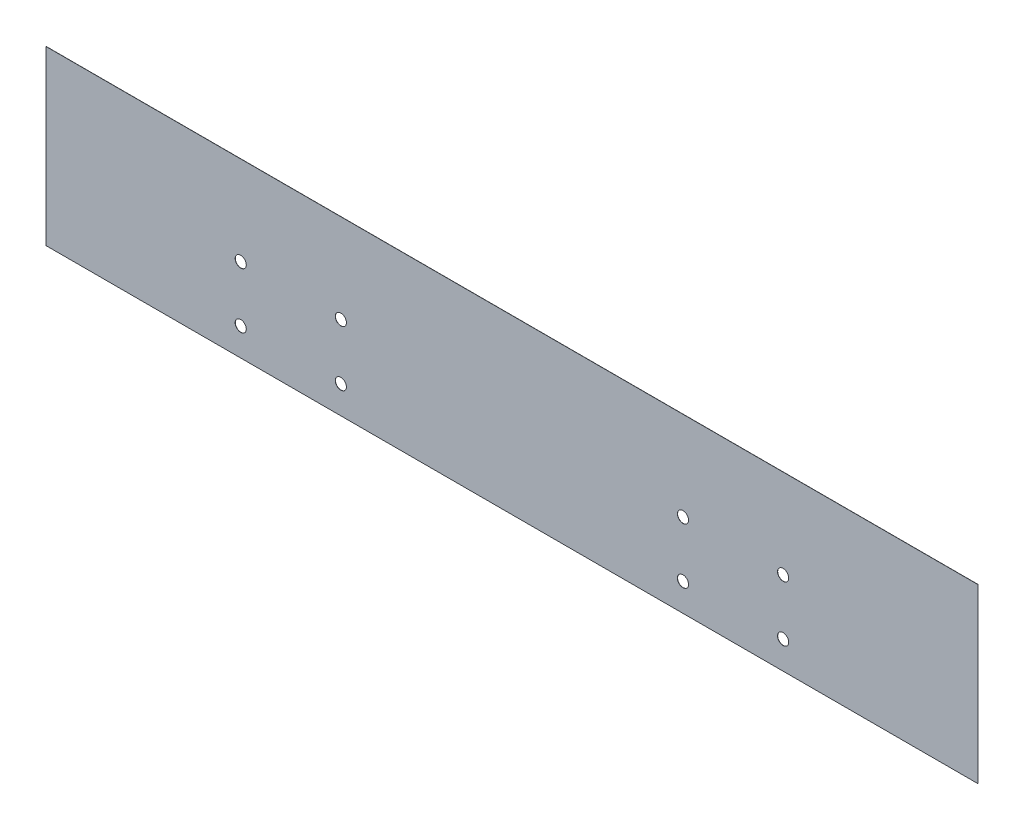
ISO-10303-21;
HEADER;
FILE_DESCRIPTION(('STEP AP214'),'2;1');
FILE_NAME('part.step','',(''),(''),'','','');
FILE_SCHEMA(('AUTOMOTIVE_DESIGN { 1 0 10303 214 1 1 1 1 }'));
ENDSEC;
DATA;
#1=APPLICATION_CONTEXT('core data for automotive mechanical design processes');
#2=APPLICATION_PROTOCOL_DEFINITION('international standard','automotive_design',2000,#1);
#3=PRODUCT_CONTEXT('',#1,'mechanical');
#4=PRODUCT('Part','Part','',(#3));
#5=PRODUCT_RELATED_PRODUCT_CATEGORY('part','',(#4));
#6=PRODUCT_DEFINITION_FORMATION('','',#4);
#7=PRODUCT_DEFINITION_CONTEXT('part definition',#1,'design');
#8=PRODUCT_DEFINITION('design','',#6,#7);
#9=PRODUCT_DEFINITION_SHAPE('','',#8);
#10=(LENGTH_UNIT() NAMED_UNIT(*) SI_UNIT(.MILLI.,.METRE.));
#11=(NAMED_UNIT(*) PLANE_ANGLE_UNIT() SI_UNIT($,.RADIAN.));
#12=(NAMED_UNIT(*) SI_UNIT($,.STERADIAN.) SOLID_ANGLE_UNIT());
#13=UNCERTAINTY_MEASURE_WITH_UNIT(LENGTH_MEASURE(1.E-05),#10,'distance_accuracy_value','');
#14=(GEOMETRIC_REPRESENTATION_CONTEXT(3) GLOBAL_UNCERTAINTY_ASSIGNED_CONTEXT((#13)) GLOBAL_UNIT_ASSIGNED_CONTEXT((#10,
#11,#12)) REPRESENTATION_CONTEXT('',''));
#15=CARTESIAN_POINT('',(0.,0.,0.));
#16=DIRECTION('',(0.,0.,1.));
#17=DIRECTION('',(1.,0.,0.));
#18=AXIS2_PLACEMENT_3D('',#15,#16,#17);
#19=CARTESIAN_POINT('',(167.5,-31.,0.0625));
#20=DIRECTION('',(-1.,0.,0.));
#21=DIRECTION('',(0.,0.,1.));
#22=AXIS2_PLACEMENT_3D('',#19,#20,#21);
#23=PLANE('',#22);
#24=DIRECTION('',(0.,1.,0.));
#25=VECTOR('',#24,1.);
#26=CARTESIAN_POINT('',(167.5,-31.,0.));
#27=LINE('',#26,#25);
#28=CARTESIAN_POINT('',(167.5,-31.,0.));
#29=VERTEX_POINT('',#28);
#30=CARTESIAN_POINT('',(167.5,31.,0.));
#31=VERTEX_POINT('',#30);
#32=EDGE_CURVE('E96',#29,#31,#27,.T.);
#33=ORIENTED_EDGE('',*,*,#32,.T.);
#34=DIRECTION('',(0.,0.,-1.));
#35=VECTOR('',#34,1.);
#36=CARTESIAN_POINT('',(167.5,31.,0.0625));
#37=LINE('',#36,#35);
#38=CARTESIAN_POINT('',(167.5,31.,0.0625));
#39=VERTEX_POINT('',#38);
#40=EDGE_CURVE('E11',#39,#31,#37,.T.);
#41=ORIENTED_EDGE('',*,*,#40,.F.);
#42=DIRECTION('',(0.,1.,0.));
#43=VECTOR('',#42,1.);
#44=CARTESIAN_POINT('',(167.5,-31.,0.0625));
#45=LINE('',#44,#43);
#46=CARTESIAN_POINT('',(167.5,-31.,0.0625));
#47=VERTEX_POINT('',#46);
#48=EDGE_CURVE('E84',#47,#39,#45,.T.);
#49=ORIENTED_EDGE('',*,*,#48,.F.);
#50=DIRECTION('',(0.,0.,-1.));
#51=VECTOR('',#50,1.);
#52=CARTESIAN_POINT('',(167.5,-31.,0.0625));
#53=LINE('',#52,#51);
#54=EDGE_CURVE('E92',#47,#29,#53,.T.);
#55=ORIENTED_EDGE('',*,*,#54,.T.);
#56=EDGE_LOOP('',(#33,#41,#49,#55));
#57=FACE_BOUND('',#56,.T.);
#58=ADVANCED_FACE('F33',(#57),#23,.F.);
#59=CARTESIAN_POINT('',(-167.5,31.,0.0625));
#60=DIRECTION('',(0.,-1.,0.));
#61=DIRECTION('',(0.,0.,-1.));
#62=AXIS2_PLACEMENT_3D('',#59,#60,#61);
#63=PLANE('',#62);
#64=DIRECTION('',(-1.,0.,0.));
#65=VECTOR('',#64,1.);
#66=CARTESIAN_POINT('',(-167.5,31.,0.));
#67=LINE('',#66,#65);
#68=CARTESIAN_POINT('',(-167.5,31.,0.));
#69=VERTEX_POINT('',#68);
#70=EDGE_CURVE('E88',#31,#69,#67,.T.);
#71=ORIENTED_EDGE('',*,*,#70,.T.);
#72=DIRECTION('',(0.,0.,-1.));
#73=VECTOR('',#72,1.);
#74=CARTESIAN_POINT('',(-167.5,31.,0.0625));
#75=LINE('',#74,#73);
#76=CARTESIAN_POINT('',(-167.5,31.,0.0625));
#77=VERTEX_POINT('',#76);
#78=EDGE_CURVE('E41',#77,#69,#75,.T.);
#79=ORIENTED_EDGE('',*,*,#78,.F.);
#80=DIRECTION('',(-1.,0.,0.));
#81=VECTOR('',#80,1.);
#82=CARTESIAN_POINT('',(-167.5,31.,0.0625));
#83=LINE('',#82,#81);
#84=EDGE_CURVE('E79',#39,#77,#83,.T.);
#85=ORIENTED_EDGE('',*,*,#84,.F.);
#86=ORIENTED_EDGE('',*,*,#40,.T.);
#87=EDGE_LOOP('',(#71,#79,#85,#86));
#88=FACE_BOUND('',#87,.T.);
#89=ADVANCED_FACE('F87',(#88),#63,.F.);
#90=CARTESIAN_POINT('',(-167.5,-31.,0.0625));
#91=DIRECTION('',(1.,0.,0.));
#92=DIRECTION('',(0.,0.,-1.));
#93=AXIS2_PLACEMENT_3D('',#90,#91,#92);
#94=PLANE('',#93);
#95=DIRECTION('',(0.,-1.,0.));
#96=VECTOR('',#95,1.);
#97=CARTESIAN_POINT('',(-167.5,-31.,0.));
#98=LINE('',#97,#96);
#99=CARTESIAN_POINT('',(-167.5,-31.,0.));
#100=VERTEX_POINT('',#99);
#101=EDGE_CURVE('E66',#69,#100,#98,.T.);
#102=ORIENTED_EDGE('',*,*,#101,.T.);
#103=DIRECTION('',(0.,0.,-1.));
#104=VECTOR('',#103,1.);
#105=CARTESIAN_POINT('',(-167.5,-31.,0.0625));
#106=LINE('',#105,#104);
#107=CARTESIAN_POINT('',(-167.5,-31.,0.0625));
#108=VERTEX_POINT('',#107);
#109=EDGE_CURVE('E89',#108,#100,#106,.T.);
#110=ORIENTED_EDGE('',*,*,#109,.F.);
#111=DIRECTION('',(0.,-1.,0.));
#112=VECTOR('',#111,1.);
#113=CARTESIAN_POINT('',(-167.5,-31.,0.0625));
#114=LINE('',#113,#112);
#115=EDGE_CURVE('E82',#77,#108,#114,.T.);
#116=ORIENTED_EDGE('',*,*,#115,.F.);
#117=ORIENTED_EDGE('',*,*,#78,.T.);
#118=EDGE_LOOP('',(#102,#110,#116,#117));
#119=FACE_BOUND('',#118,.T.);
#120=ADVANCED_FACE('F90',(#119),#94,.F.);
#121=CARTESIAN_POINT('',(-167.5,-31.,0.0625));
#122=DIRECTION('',(0.,1.,0.));
#123=DIRECTION('',(0.,0.,1.));
#124=AXIS2_PLACEMENT_3D('',#121,#122,#123);
#125=PLANE('',#124);
#126=DIRECTION('',(1.,0.,0.));
#127=VECTOR('',#126,1.);
#128=CARTESIAN_POINT('',(-167.5,-31.,0.));
#129=LINE('',#128,#127);
#130=EDGE_CURVE('E72',#100,#29,#129,.T.);
#131=ORIENTED_EDGE('',*,*,#130,.T.);
#132=ORIENTED_EDGE('',*,*,#54,.F.);
#133=DIRECTION('',(1.,0.,0.));
#134=VECTOR('',#133,1.);
#135=CARTESIAN_POINT('',(-167.5,-31.,0.0625));
#136=LINE('',#135,#134);
#137=EDGE_CURVE('E49',#108,#47,#136,.T.);
#138=ORIENTED_EDGE('',*,*,#137,.F.);
#139=ORIENTED_EDGE('',*,*,#109,.T.);
#140=EDGE_LOOP('',(#131,#132,#138,#139));
#141=FACE_BOUND('',#140,.T.);
#142=ADVANCED_FACE('F104',(#141),#125,.F.);
#143=CARTESIAN_POINT('',(0.,0.,0.0625));
#144=DIRECTION('',(0.,0.,-1.));
#145=DIRECTION('',(-1.,0.,0.));
#146=AXIS2_PLACEMENT_3D('',#143,#144,#145);
#147=PLANE('',#146);
#148=CARTESIAN_POINT('',(-97.5,-21.,0.0625));
#149=DIRECTION('',(0.,0.,1.));
#150=DIRECTION('',(1.,0.,0.));
#151=AXIS2_PLACEMENT_3D('',#148,#149,#150);
#152=CIRCLE('',#151,2.);
#153=CARTESIAN_POINT('',(-95.5,-21.,0.0625));
#154=VERTEX_POINT('',#153);
#155=EDGE_CURVE('E147',#154,#154,#152,.T.);
#156=ORIENTED_EDGE('',*,*,#155,.F.);
#157=EDGE_LOOP('',(#156));
#158=FACE_BOUND('',#157,.T.);
#159=CARTESIAN_POINT('',(97.5,-1.,0.0625));
#160=DIRECTION('',(0.,0.,1.));
#161=DIRECTION('',(1.,0.,0.));
#162=AXIS2_PLACEMENT_3D('',#159,#160,#161);
#163=CIRCLE('',#162,2.);
#164=CARTESIAN_POINT('',(99.5,-1.,0.0625));
#165=VERTEX_POINT('',#164);
#166=EDGE_CURVE('E140',#165,#165,#163,.T.);
#167=ORIENTED_EDGE('',*,*,#166,.F.);
#168=EDGE_LOOP('',(#167));
#169=FACE_BOUND('',#168,.T.);
#170=CARTESIAN_POINT('',(97.5,-21.,0.0625));
#171=DIRECTION('',(0.,0.,1.));
#172=DIRECTION('',(1.,0.,0.));
#173=AXIS2_PLACEMENT_3D('',#170,#171,#172);
#174=CIRCLE('',#173,2.);
#175=CARTESIAN_POINT('',(99.5,-21.,0.0625));
#176=VERTEX_POINT('',#175);
#177=EDGE_CURVE('E152',#176,#176,#174,.T.);
#178=ORIENTED_EDGE('',*,*,#177,.F.);
#179=EDGE_LOOP('',(#178));
#180=FACE_BOUND('',#179,.T.);
#181=CARTESIAN_POINT('',(-97.5,-1.,0.0625));
#182=DIRECTION('',(0.,0.,1.));
#183=DIRECTION('',(1.,0.,0.));
#184=AXIS2_PLACEMENT_3D('',#181,#182,#183);
#185=CIRCLE('',#184,2.);
#186=CARTESIAN_POINT('',(-95.5,-1.,0.0625));
#187=VERTEX_POINT('',#186);
#188=EDGE_CURVE('E134',#187,#187,#185,.T.);
#189=ORIENTED_EDGE('',*,*,#188,.F.);
#190=EDGE_LOOP('',(#189));
#191=FACE_BOUND('',#190,.T.);
#192=CARTESIAN_POINT('',(-61.5,-21.,0.0625));
#193=DIRECTION('',(0.,0.,1.));
#194=DIRECTION('',(1.,0.,0.));
#195=AXIS2_PLACEMENT_3D('',#192,#193,#194);
#196=CIRCLE('',#195,2.);
#197=CARTESIAN_POINT('',(-59.5,-21.,0.0625));
#198=VERTEX_POINT('',#197);
#199=EDGE_CURVE('E123',#198,#198,#196,.T.);
#200=ORIENTED_EDGE('',*,*,#199,.F.);
#201=EDGE_LOOP('',(#200));
#202=FACE_BOUND('',#201,.T.);
#203=CARTESIAN_POINT('',(61.5,-1.,0.0625));
#204=DIRECTION('',(0.,0.,1.));
#205=DIRECTION('',(1.,0.,0.));
#206=AXIS2_PLACEMENT_3D('',#203,#204,#205);
#207=CIRCLE('',#206,1.99999999999999);
#208=CARTESIAN_POINT('',(63.5,-1.,0.0625));
#209=VERTEX_POINT('',#208);
#210=EDGE_CURVE('E116',#209,#209,#207,.T.);
#211=ORIENTED_EDGE('',*,*,#210,.F.);
#212=EDGE_LOOP('',(#211));
#213=FACE_BOUND('',#212,.T.);
#214=CARTESIAN_POINT('',(61.5,-21.,0.0625));
#215=DIRECTION('',(0.,0.,1.));
#216=DIRECTION('',(1.,0.,0.));
#217=AXIS2_PLACEMENT_3D('',#214,#215,#216);
#218=CIRCLE('',#217,1.99999999999999);
#219=CARTESIAN_POINT('',(63.5,-21.,0.0625));
#220=VERTEX_POINT('',#219);
#221=EDGE_CURVE('E128',#220,#220,#218,.T.);
#222=ORIENTED_EDGE('',*,*,#221,.F.);
#223=EDGE_LOOP('',(#222));
#224=FACE_BOUND('',#223,.T.);
#225=CARTESIAN_POINT('',(-61.5,-1.00000000000002,0.0625));
#226=DIRECTION('',(0.,0.,1.));
#227=DIRECTION('',(1.,0.,0.));
#228=AXIS2_PLACEMENT_3D('',#225,#226,#227);
#229=CIRCLE('',#228,2.);
#230=CARTESIAN_POINT('',(-59.5,-1.00000000000002,0.0625));
#231=VERTEX_POINT('',#230);
#232=EDGE_CURVE('E110',#231,#231,#229,.T.);
#233=ORIENTED_EDGE('',*,*,#232,.F.);
#234=EDGE_LOOP('',(#233));
#235=FACE_BOUND('',#234,.T.);
#236=ORIENTED_EDGE('',*,*,#48,.T.);
#237=ORIENTED_EDGE('',*,*,#84,.T.);
#238=ORIENTED_EDGE('',*,*,#115,.T.);
#239=ORIENTED_EDGE('',*,*,#137,.T.);
#240=EDGE_LOOP('',(#236,#237,#238,#239));
#241=FACE_BOUND('',#240,.T.);
#242=ADVANCED_FACE('F80',(#158,#169,#180,#191,#202,#213,#224,#235,#241),#147,.F.);
#243=CARTESIAN_POINT('',(0.,0.,0.));
#244=DIRECTION('',(0.,0.,-1.));
#245=DIRECTION('',(-1.,0.,0.));
#246=AXIS2_PLACEMENT_3D('',#243,#244,#245);
#247=PLANE('',#246);
#248=CARTESIAN_POINT('',(-97.5,-21.,0.));
#249=DIRECTION('',(0.,0.,1.));
#250=DIRECTION('',(1.,0.,0.));
#251=AXIS2_PLACEMENT_3D('',#248,#249,#250);
#252=CIRCLE('',#251,2.);
#253=CARTESIAN_POINT('',(-95.5,-21.,0.));
#254=VERTEX_POINT('',#253);
#255=EDGE_CURVE('E137',#254,#254,#252,.T.);
#256=ORIENTED_EDGE('',*,*,#255,.T.);
#257=EDGE_LOOP('',(#256));
#258=FACE_BOUND('',#257,.T.);
#259=CARTESIAN_POINT('',(97.5,-1.,0.));
#260=DIRECTION('',(0.,0.,1.));
#261=DIRECTION('',(1.,0.,0.));
#262=AXIS2_PLACEMENT_3D('',#259,#260,#261);
#263=CIRCLE('',#262,2.);
#264=CARTESIAN_POINT('',(99.5,-1.,0.));
#265=VERTEX_POINT('',#264);
#266=EDGE_CURVE('E143',#265,#265,#263,.T.);
#267=ORIENTED_EDGE('',*,*,#266,.T.);
#268=EDGE_LOOP('',(#267));
#269=FACE_BOUND('',#268,.T.);
#270=CARTESIAN_POINT('',(97.5,-21.,0.));
#271=DIRECTION('',(0.,0.,1.));
#272=DIRECTION('',(1.,0.,0.));
#273=AXIS2_PLACEMENT_3D('',#270,#271,#272);
#274=CIRCLE('',#273,2.);
#275=CARTESIAN_POINT('',(99.5,-21.,0.));
#276=VERTEX_POINT('',#275);
#277=EDGE_CURVE('E144',#276,#276,#274,.T.);
#278=ORIENTED_EDGE('',*,*,#277,.T.);
#279=EDGE_LOOP('',(#278));
#280=FACE_BOUND('',#279,.T.);
#281=CARTESIAN_POINT('',(-97.5,-1.,0.));
#282=DIRECTION('',(0.,0.,1.));
#283=DIRECTION('',(1.,0.,0.));
#284=AXIS2_PLACEMENT_3D('',#281,#282,#283);
#285=CIRCLE('',#284,2.);
#286=CARTESIAN_POINT('',(-95.5,-1.,0.));
#287=VERTEX_POINT('',#286);
#288=EDGE_CURVE('E131',#287,#287,#285,.T.);
#289=ORIENTED_EDGE('',*,*,#288,.T.);
#290=EDGE_LOOP('',(#289));
#291=FACE_BOUND('',#290,.T.);
#292=CARTESIAN_POINT('',(-61.5,-21.,0.));
#293=DIRECTION('',(0.,0.,1.));
#294=DIRECTION('',(1.,0.,0.));
#295=AXIS2_PLACEMENT_3D('',#292,#293,#294);
#296=CIRCLE('',#295,2.);
#297=CARTESIAN_POINT('',(-59.5,-21.,0.));
#298=VERTEX_POINT('',#297);
#299=EDGE_CURVE('E113',#298,#298,#296,.T.);
#300=ORIENTED_EDGE('',*,*,#299,.T.);
#301=EDGE_LOOP('',(#300));
#302=FACE_BOUND('',#301,.T.);
#303=CARTESIAN_POINT('',(61.5,-1.,0.));
#304=DIRECTION('',(0.,0.,1.));
#305=DIRECTION('',(1.,0.,0.));
#306=AXIS2_PLACEMENT_3D('',#303,#304,#305);
#307=CIRCLE('',#306,1.99999999999999);
#308=CARTESIAN_POINT('',(63.5,-1.,0.));
#309=VERTEX_POINT('',#308);
#310=EDGE_CURVE('E119',#309,#309,#307,.T.);
#311=ORIENTED_EDGE('',*,*,#310,.T.);
#312=EDGE_LOOP('',(#311));
#313=FACE_BOUND('',#312,.T.);
#314=CARTESIAN_POINT('',(61.5,-21.,0.));
#315=DIRECTION('',(0.,0.,1.));
#316=DIRECTION('',(1.,0.,0.));
#317=AXIS2_PLACEMENT_3D('',#314,#315,#316);
#318=CIRCLE('',#317,1.99999999999999);
#319=CARTESIAN_POINT('',(63.5,-21.,0.));
#320=VERTEX_POINT('',#319);
#321=EDGE_CURVE('E120',#320,#320,#318,.T.);
#322=ORIENTED_EDGE('',*,*,#321,.T.);
#323=EDGE_LOOP('',(#322));
#324=FACE_BOUND('',#323,.T.);
#325=CARTESIAN_POINT('',(-61.5,-1.00000000000002,0.));
#326=DIRECTION('',(0.,0.,1.));
#327=DIRECTION('',(1.,0.,0.));
#328=AXIS2_PLACEMENT_3D('',#325,#326,#327);
#329=CIRCLE('',#328,2.);
#330=CARTESIAN_POINT('',(-59.5,-1.00000000000002,0.));
#331=VERTEX_POINT('',#330);
#332=EDGE_CURVE('E99',#331,#331,#329,.T.);
#333=ORIENTED_EDGE('',*,*,#332,.T.);
#334=EDGE_LOOP('',(#333));
#335=FACE_BOUND('',#334,.T.);
#336=ORIENTED_EDGE('',*,*,#32,.F.);
#337=ORIENTED_EDGE('',*,*,#130,.F.);
#338=ORIENTED_EDGE('',*,*,#101,.F.);
#339=ORIENTED_EDGE('',*,*,#70,.F.);
#340=EDGE_LOOP('',(#336,#337,#338,#339));
#341=FACE_BOUND('',#340,.T.);
#342=ADVANCED_FACE('F107',(#258,#269,#280,#291,#302,#313,#324,#335,#341),#247,.T.);
#343=CARTESIAN_POINT('',(-61.5,-1.00000000000002,0.));
#344=DIRECTION('',(0.,0.,1.));
#345=DIRECTION('',(1.,0.,0.));
#346=AXIS2_PLACEMENT_3D('',#343,#344,#345);
#347=CYLINDRICAL_SURFACE('',#346,2.);
#348=ORIENTED_EDGE('',*,*,#332,.F.);
#349=EDGE_LOOP('',(#348));
#350=FACE_BOUND('',#349,.T.);
#351=ORIENTED_EDGE('',*,*,#232,.T.);
#352=EDGE_LOOP('',(#351));
#353=FACE_BOUND('',#352,.T.);
#354=ADVANCED_FACE('F182',(#350,#353),#347,.F.);
#355=CARTESIAN_POINT('',(61.5,-21.,0.));
#356=DIRECTION('',(0.,0.,1.));
#357=DIRECTION('',(1.,0.,0.));
#358=AXIS2_PLACEMENT_3D('',#355,#356,#357);
#359=CYLINDRICAL_SURFACE('',#358,1.99999999999999);
#360=ORIENTED_EDGE('',*,*,#321,.F.);
#361=EDGE_LOOP('',(#360));
#362=FACE_BOUND('',#361,.T.);
#363=ORIENTED_EDGE('',*,*,#221,.T.);
#364=EDGE_LOOP('',(#363));
#365=FACE_BOUND('',#364,.T.);
#366=ADVANCED_FACE('F184',(#362,#365),#359,.F.);
#367=CARTESIAN_POINT('',(61.5,-1.,0.));
#368=DIRECTION('',(0.,0.,1.));
#369=DIRECTION('',(1.,0.,0.));
#370=AXIS2_PLACEMENT_3D('',#367,#368,#369);
#371=CYLINDRICAL_SURFACE('',#370,1.99999999999999);
#372=ORIENTED_EDGE('',*,*,#310,.F.);
#373=EDGE_LOOP('',(#372));
#374=FACE_BOUND('',#373,.T.);
#375=ORIENTED_EDGE('',*,*,#210,.T.);
#376=EDGE_LOOP('',(#375));
#377=FACE_BOUND('',#376,.T.);
#378=ADVANCED_FACE('F191',(#374,#377),#371,.F.);
#379=CARTESIAN_POINT('',(-61.5,-21.,0.));
#380=DIRECTION('',(0.,0.,1.));
#381=DIRECTION('',(1.,0.,0.));
#382=AXIS2_PLACEMENT_3D('',#379,#380,#381);
#383=CYLINDRICAL_SURFACE('',#382,2.);
#384=ORIENTED_EDGE('',*,*,#299,.F.);
#385=EDGE_LOOP('',(#384));
#386=FACE_BOUND('',#385,.T.);
#387=ORIENTED_EDGE('',*,*,#199,.T.);
#388=EDGE_LOOP('',(#387));
#389=FACE_BOUND('',#388,.T.);
#390=ADVANCED_FACE('F231',(#386,#389),#383,.F.);
#391=CARTESIAN_POINT('',(-97.5,-1.,0.));
#392=DIRECTION('',(0.,0.,1.));
#393=DIRECTION('',(1.,0.,0.));
#394=AXIS2_PLACEMENT_3D('',#391,#392,#393);
#395=CYLINDRICAL_SURFACE('',#394,2.);
#396=ORIENTED_EDGE('',*,*,#288,.F.);
#397=EDGE_LOOP('',(#396));
#398=FACE_BOUND('',#397,.T.);
#399=ORIENTED_EDGE('',*,*,#188,.T.);
#400=EDGE_LOOP('',(#399));
#401=FACE_BOUND('',#400,.T.);
#402=ADVANCED_FACE('F164',(#398,#401),#395,.F.);
#403=CARTESIAN_POINT('',(97.5,-21.,0.));
#404=DIRECTION('',(0.,0.,1.));
#405=DIRECTION('',(1.,0.,0.));
#406=AXIS2_PLACEMENT_3D('',#403,#404,#405);
#407=CYLINDRICAL_SURFACE('',#406,2.);
#408=ORIENTED_EDGE('',*,*,#277,.F.);
#409=EDGE_LOOP('',(#408));
#410=FACE_BOUND('',#409,.T.);
#411=ORIENTED_EDGE('',*,*,#177,.T.);
#412=EDGE_LOOP('',(#411));
#413=FACE_BOUND('',#412,.T.);
#414=ADVANCED_FACE('F160',(#410,#413),#407,.F.);
#415=CARTESIAN_POINT('',(97.5,-1.,0.));
#416=DIRECTION('',(0.,0.,1.));
#417=DIRECTION('',(1.,0.,0.));
#418=AXIS2_PLACEMENT_3D('',#415,#416,#417);
#419=CYLINDRICAL_SURFACE('',#418,2.);
#420=ORIENTED_EDGE('',*,*,#266,.F.);
#421=EDGE_LOOP('',(#420));
#422=FACE_BOUND('',#421,.T.);
#423=ORIENTED_EDGE('',*,*,#166,.T.);
#424=EDGE_LOOP('',(#423));
#425=FACE_BOUND('',#424,.T.);
#426=ADVANCED_FACE('F163',(#422,#425),#419,.F.);
#427=CARTESIAN_POINT('',(-97.5,-21.,0.));
#428=DIRECTION('',(0.,0.,1.));
#429=DIRECTION('',(1.,0.,0.));
#430=AXIS2_PLACEMENT_3D('',#427,#428,#429);
#431=CYLINDRICAL_SURFACE('',#430,2.);
#432=ORIENTED_EDGE('',*,*,#255,.F.);
#433=EDGE_LOOP('',(#432));
#434=FACE_BOUND('',#433,.T.);
#435=ORIENTED_EDGE('',*,*,#155,.T.);
#436=EDGE_LOOP('',(#435));
#437=FACE_BOUND('',#436,.T.);
#438=ADVANCED_FACE('F249',(#434,#437),#431,.F.);
#439=CLOSED_SHELL('',(#58,#89,#120,#142,#242,#342,#354,#366,#378,#390,#402,#414,#426,#438));
#440=MANIFOLD_SOLID_BREP('B2',#439);
#441=ADVANCED_BREP_SHAPE_REPRESENTATION('',(#18,#440),#14);
#442=SHAPE_DEFINITION_REPRESENTATION(#9,#441);
ENDSEC;
END-ISO-10303-21;
